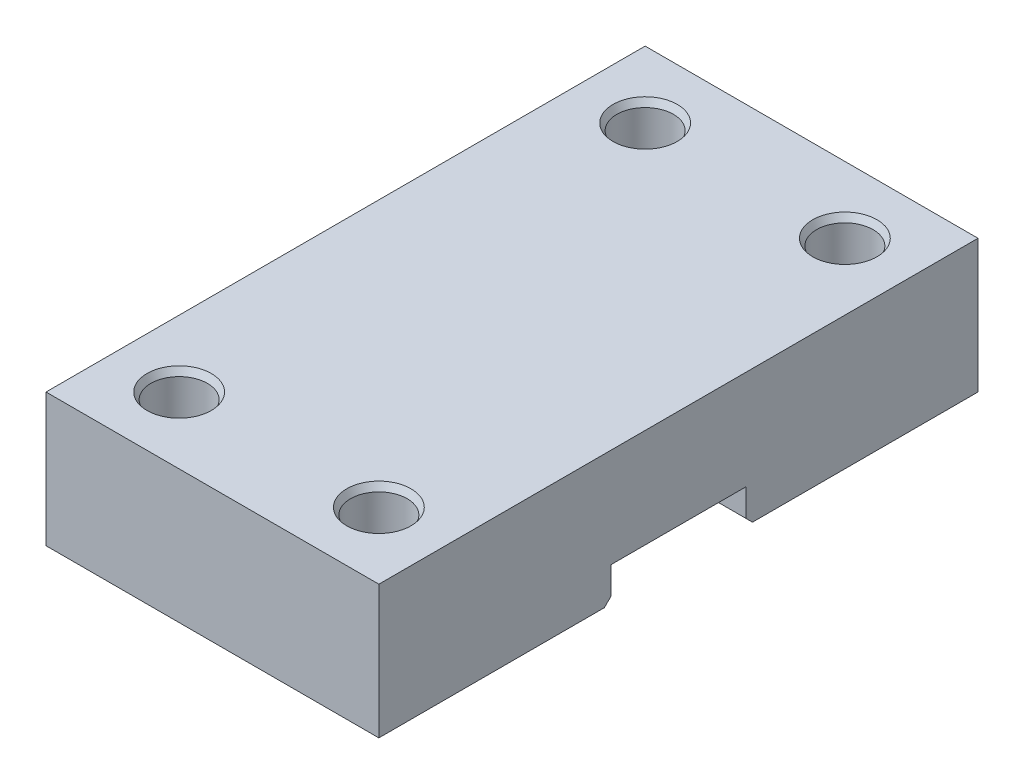
ISO-10303-21;
HEADER;
FILE_DESCRIPTION(('STEP AP214'),'2;1');
FILE_NAME('part.step','',(''),(''),'','','');
FILE_SCHEMA(('AUTOMOTIVE_DESIGN { 1 0 10303 214 1 1 1 1 }'));
ENDSEC;
DATA;
#1=APPLICATION_CONTEXT('core data for automotive mechanical design processes');
#2=APPLICATION_PROTOCOL_DEFINITION('international standard','automotive_design',2000,#1);
#3=PRODUCT_CONTEXT('',#1,'mechanical');
#4=PRODUCT('Part','Part','',(#3));
#5=PRODUCT_RELATED_PRODUCT_CATEGORY('part','',(#4));
#6=PRODUCT_DEFINITION_FORMATION('','',#4);
#7=PRODUCT_DEFINITION_CONTEXT('part definition',#1,'design');
#8=PRODUCT_DEFINITION('design','',#6,#7);
#9=PRODUCT_DEFINITION_SHAPE('','',#8);
#10=(LENGTH_UNIT() NAMED_UNIT(*) SI_UNIT(.MILLI.,.METRE.));
#11=(NAMED_UNIT(*) PLANE_ANGLE_UNIT() SI_UNIT($,.RADIAN.));
#12=(NAMED_UNIT(*) SI_UNIT($,.STERADIAN.) SOLID_ANGLE_UNIT());
#13=UNCERTAINTY_MEASURE_WITH_UNIT(LENGTH_MEASURE(1.E-05),#10,'distance_accuracy_value','');
#14=(GEOMETRIC_REPRESENTATION_CONTEXT(3) GLOBAL_UNCERTAINTY_ASSIGNED_CONTEXT((#13)) GLOBAL_UNIT_ASSIGNED_CONTEXT((#10,
#11,#12)) REPRESENTATION_CONTEXT('',''));
#15=CARTESIAN_POINT('',(0.,0.,0.));
#16=DIRECTION('',(0.,0.,1.));
#17=DIRECTION('',(1.,0.,0.));
#18=AXIS2_PLACEMENT_3D('',#15,#16,#17);
#19=CARTESIAN_POINT('',(0.,0.,0.));
#20=DIRECTION('',(0.,1.,0.));
#21=DIRECTION('',(0.,0.,1.));
#22=AXIS2_PLACEMENT_3D('',#19,#20,#21);
#23=PLANE('',#22);
#24=CARTESIAN_POINT('',(15.,0.,35.));
#25=DIRECTION('',(0.,-1.,0.));
#26=DIRECTION('',(0.,0.,-1.));
#27=AXIS2_PLACEMENT_3D('',#24,#25,#26);
#28=CIRCLE('',#27,4.25);
#29=CARTESIAN_POINT('',(15.,0.,30.75));
#30=VERTEX_POINT('',#29);
#31=EDGE_CURVE('E241',#30,#30,#28,.T.);
#32=ORIENTED_EDGE('',*,*,#31,.F.);
#33=EDGE_LOOP('',(#32));
#34=FACE_BOUND('',#33,.T.);
#35=CARTESIAN_POINT('',(-15.,0.,35.));
#36=DIRECTION('',(0.,-1.,0.));
#37=DIRECTION('',(0.,0.,-1.));
#38=AXIS2_PLACEMENT_3D('',#35,#36,#37);
#39=CIRCLE('',#38,4.25);
#40=CARTESIAN_POINT('',(-15.,0.,30.75));
#41=VERTEX_POINT('',#40);
#42=EDGE_CURVE('E239',#41,#41,#39,.T.);
#43=ORIENTED_EDGE('',*,*,#42,.F.);
#44=EDGE_LOOP('',(#43));
#45=FACE_BOUND('',#44,.T.);
#46=DIRECTION('',(0.,0.,1.));
#47=VECTOR('',#46,1.);
#48=CARTESIAN_POINT('',(-25.,0.,45.));
#49=LINE('',#48,#47);
#50=CARTESIAN_POINT('',(-25.,0.,11.125));
#51=VERTEX_POINT('',#50);
#52=CARTESIAN_POINT('',(-25.,0.,45.));
#53=VERTEX_POINT('',#52);
#54=EDGE_CURVE('E142',#51,#53,#49,.T.);
#55=ORIENTED_EDGE('',*,*,#54,.F.);
#56=DIRECTION('',(1.,0.,0.));
#57=VECTOR('',#56,1.);
#58=CARTESIAN_POINT('',(0.,0.,11.125));
#59=LINE('',#58,#57);
#60=CARTESIAN_POINT('',(25.,0.,11.125));
#61=VERTEX_POINT('',#60);
#62=EDGE_CURVE('E42',#51,#61,#59,.T.);
#63=ORIENTED_EDGE('',*,*,#62,.T.);
#64=DIRECTION('',(0.,0.,-1.));
#65=VECTOR('',#64,1.);
#66=CARTESIAN_POINT('',(25.,0.,45.));
#67=LINE('',#66,#65);
#68=CARTESIAN_POINT('',(25.,0.,45.));
#69=VERTEX_POINT('',#68);
#70=EDGE_CURVE('E159',#69,#61,#67,.T.);
#71=ORIENTED_EDGE('',*,*,#70,.F.);
#72=DIRECTION('',(1.,0.,0.));
#73=VECTOR('',#72,1.);
#74=CARTESIAN_POINT('',(25.,0.,45.));
#75=LINE('',#74,#73);
#76=EDGE_CURVE('E156',#53,#69,#75,.T.);
#77=ORIENTED_EDGE('',*,*,#76,.F.);
#78=EDGE_LOOP('',(#55,#63,#71,#77));
#79=FACE_BOUND('',#78,.T.);
#80=ADVANCED_FACE('F34',(#34,#45,#79),#23,.F.);
#81=CARTESIAN_POINT('',(-25.,20.,45.));
#82=DIRECTION('',(1.,0.,0.));
#83=DIRECTION('',(0.,0.,-1.));
#84=AXIS2_PLACEMENT_3D('',#81,#82,#83);
#85=PLANE('',#84);
#86=CARTESIAN_POINT('',(-25.,0.,-45.));
#87=VERTEX_POINT('',#86);
#88=CARTESIAN_POINT('',(-25.,0.,-11.125));
#89=VERTEX_POINT('',#88);
#90=EDGE_CURVE('E154',#87,#89,#49,.T.);
#91=ORIENTED_EDGE('',*,*,#90,.T.);
#92=DIRECTION('',(0.,-0.707106781186552,-0.707106781186543));
#93=VECTOR('',#92,1.);
#94=CARTESIAN_POINT('',(-25.,1.00000000000003,-10.125));
#95=LINE('',#94,#93);
#96=CARTESIAN_POINT('',(-25.,1.00000000000003,-10.125));
#97=VERTEX_POINT('',#96);
#98=EDGE_CURVE('E117',#89,#97,#95,.F.);
#99=ORIENTED_EDGE('',*,*,#98,.T.);
#100=DIRECTION('',(0.,1.,0.));
#101=VECTOR('',#100,1.);
#102=CARTESIAN_POINT('',(-25.,5.10000000000001,-10.125));
#103=LINE('',#102,#101);
#104=CARTESIAN_POINT('',(-25.,5.10000000000001,-10.125));
#105=VERTEX_POINT('',#104);
#106=EDGE_CURVE('E110',#97,#105,#103,.T.);
#107=ORIENTED_EDGE('',*,*,#106,.T.);
#108=DIRECTION('',(0.,0.,1.));
#109=VECTOR('',#108,1.);
#110=CARTESIAN_POINT('',(-25.,5.10000000000001,-10.125));
#111=LINE('',#110,#109);
#112=CARTESIAN_POINT('',(-25.,5.1,10.125));
#113=VERTEX_POINT('',#112);
#114=EDGE_CURVE('E115',#105,#113,#111,.T.);
#115=ORIENTED_EDGE('',*,*,#114,.T.);
#116=DIRECTION('',(0.,-1.,0.));
#117=VECTOR('',#116,1.);
#118=CARTESIAN_POINT('',(-25.,5.1,10.125));
#119=LINE('',#118,#117);
#120=CARTESIAN_POINT('',(-25.,1.00000000000001,10.125));
#121=VERTEX_POINT('',#120);
#122=EDGE_CURVE('E121',#113,#121,#119,.T.);
#123=ORIENTED_EDGE('',*,*,#122,.T.);
#124=DIRECTION('',(0.,0.707106781186548,-0.707106781186548));
#125=VECTOR('',#124,1.);
#126=CARTESIAN_POINT('',(-25.,0.,11.125));
#127=LINE('',#126,#125);
#128=EDGE_CURVE('E49',#121,#51,#127,.F.);
#129=ORIENTED_EDGE('',*,*,#128,.T.);
#130=ORIENTED_EDGE('',*,*,#54,.T.);
#131=DIRECTION('',(0.,-1.,0.));
#132=VECTOR('',#131,1.);
#133=CARTESIAN_POINT('',(-25.,20.,45.));
#134=LINE('',#133,#132);
#135=CARTESIAN_POINT('',(-25.,20.,45.));
#136=VERTEX_POINT('',#135);
#137=EDGE_CURVE('E171',#136,#53,#134,.T.);
#138=ORIENTED_EDGE('',*,*,#137,.F.);
#139=DIRECTION('',(0.,0.,1.));
#140=VECTOR('',#139,1.);
#141=CARTESIAN_POINT('',(-25.,20.,45.));
#142=LINE('',#141,#140);
#143=CARTESIAN_POINT('',(-25.,20.,-45.));
#144=VERTEX_POINT('',#143);
#145=EDGE_CURVE('E143',#144,#136,#142,.T.);
#146=ORIENTED_EDGE('',*,*,#145,.F.);
#147=DIRECTION('',(0.,-1.,0.));
#148=VECTOR('',#147,1.);
#149=CARTESIAN_POINT('',(-25.,20.,-45.));
#150=LINE('',#149,#148);
#151=EDGE_CURVE('E153',#144,#87,#150,.T.);
#152=ORIENTED_EDGE('',*,*,#151,.T.);
#153=EDGE_LOOP('',(#91,#99,#107,#115,#123,#129,#130,#138,#146,#152));
#154=FACE_BOUND('',#153,.T.);
#155=ADVANCED_FACE('F113',(#154),#85,.F.);
#156=CARTESIAN_POINT('',(25.,20.,45.));
#157=DIRECTION('',(0.,0.,-1.));
#158=DIRECTION('',(-1.,0.,0.));
#159=AXIS2_PLACEMENT_3D('',#156,#157,#158);
#160=PLANE('',#159);
#161=ORIENTED_EDGE('',*,*,#76,.T.);
#162=DIRECTION('',(0.,-1.,0.));
#163=VECTOR('',#162,1.);
#164=CARTESIAN_POINT('',(25.,20.,45.));
#165=LINE('',#164,#163);
#166=CARTESIAN_POINT('',(25.,20.,45.));
#167=VERTEX_POINT('',#166);
#168=EDGE_CURVE('E168',#167,#69,#165,.T.);
#169=ORIENTED_EDGE('',*,*,#168,.F.);
#170=DIRECTION('',(1.,0.,0.));
#171=VECTOR('',#170,1.);
#172=CARTESIAN_POINT('',(25.,20.,45.));
#173=LINE('',#172,#171);
#174=EDGE_CURVE('E146',#136,#167,#173,.T.);
#175=ORIENTED_EDGE('',*,*,#174,.F.);
#176=ORIENTED_EDGE('',*,*,#137,.T.);
#177=EDGE_LOOP('',(#161,#169,#175,#176));
#178=FACE_BOUND('',#177,.T.);
#179=ADVANCED_FACE('F221',(#178),#160,.F.);
#180=CARTESIAN_POINT('',(25.,20.,45.));
#181=DIRECTION('',(-1.,0.,0.));
#182=DIRECTION('',(0.,0.,1.));
#183=AXIS2_PLACEMENT_3D('',#180,#181,#182);
#184=PLANE('',#183);
#185=DIRECTION('',(0.,-1.,0.));
#186=VECTOR('',#185,1.);
#187=CARTESIAN_POINT('',(25.,20.,-10.125));
#188=LINE('',#187,#186);
#189=CARTESIAN_POINT('',(25.,5.10000000000001,-10.125));
#190=VERTEX_POINT('',#189);
#191=CARTESIAN_POINT('',(25.,1.00000000000003,-10.125));
#192=VERTEX_POINT('',#191);
#193=EDGE_CURVE('E127',#190,#192,#188,.T.);
#194=ORIENTED_EDGE('',*,*,#193,.T.);
#195=DIRECTION('',(0.,0.707106781186552,0.707106781186543));
#196=VECTOR('',#195,1.);
#197=CARTESIAN_POINT('',(25.,1.00000000000003,-10.125));
#198=LINE('',#197,#196);
#199=CARTESIAN_POINT('',(25.,0.,-11.125));
#200=VERTEX_POINT('',#199);
#201=EDGE_CURVE('E204',#192,#200,#198,.F.);
#202=ORIENTED_EDGE('',*,*,#201,.T.);
#203=CARTESIAN_POINT('',(25.,0.,-45.));
#204=VERTEX_POINT('',#203);
#205=EDGE_CURVE('E158',#200,#204,#67,.T.);
#206=ORIENTED_EDGE('',*,*,#205,.T.);
#207=DIRECTION('',(0.,-1.,0.));
#208=VECTOR('',#207,1.);
#209=CARTESIAN_POINT('',(25.,20.,-45.));
#210=LINE('',#209,#208);
#211=CARTESIAN_POINT('',(25.,20.,-45.));
#212=VERTEX_POINT('',#211);
#213=EDGE_CURVE('E165',#212,#204,#210,.T.);
#214=ORIENTED_EDGE('',*,*,#213,.F.);
#215=DIRECTION('',(0.,0.,-1.));
#216=VECTOR('',#215,1.);
#217=CARTESIAN_POINT('',(25.,20.,45.));
#218=LINE('',#217,#216);
#219=EDGE_CURVE('E149',#167,#212,#218,.T.);
#220=ORIENTED_EDGE('',*,*,#219,.F.);
#221=ORIENTED_EDGE('',*,*,#168,.T.);
#222=ORIENTED_EDGE('',*,*,#70,.T.);
#223=DIRECTION('',(0.,-0.707106781186548,0.707106781186548));
#224=VECTOR('',#223,1.);
#225=CARTESIAN_POINT('',(25.,0.,11.125));
#226=LINE('',#225,#224);
#227=CARTESIAN_POINT('',(25.,1.00000000000001,10.125));
#228=VERTEX_POINT('',#227);
#229=EDGE_CURVE('E202',#61,#228,#226,.F.);
#230=ORIENTED_EDGE('',*,*,#229,.T.);
#231=DIRECTION('',(0.,1.,0.));
#232=VECTOR('',#231,1.);
#233=CARTESIAN_POINT('',(25.,20.,10.125));
#234=LINE('',#233,#232);
#235=CARTESIAN_POINT('',(25.,5.1,10.125));
#236=VERTEX_POINT('',#235);
#237=EDGE_CURVE('E140',#228,#236,#234,.T.);
#238=ORIENTED_EDGE('',*,*,#237,.T.);
#239=DIRECTION('',(0.,0.,-1.));
#240=VECTOR('',#239,1.);
#241=CARTESIAN_POINT('',(25.,5.1,45.));
#242=LINE('',#241,#240);
#243=EDGE_CURVE('E174',#236,#190,#242,.T.);
#244=ORIENTED_EDGE('',*,*,#243,.T.);
#245=EDGE_LOOP('',(#194,#202,#206,#214,#220,#221,#222,#230,#238,#244));
#246=FACE_BOUND('',#245,.T.);
#247=ADVANCED_FACE('F216',(#246),#184,.F.);
#248=CARTESIAN_POINT('',(25.,20.,-45.));
#249=DIRECTION('',(0.,0.,1.));
#250=DIRECTION('',(1.,0.,0.));
#251=AXIS2_PLACEMENT_3D('',#248,#249,#250);
#252=PLANE('',#251);
#253=DIRECTION('',(-1.,0.,0.));
#254=VECTOR('',#253,1.);
#255=CARTESIAN_POINT('',(25.,0.,-45.));
#256=LINE('',#255,#254);
#257=EDGE_CURVE('E147',#204,#87,#256,.T.);
#258=ORIENTED_EDGE('',*,*,#257,.T.);
#259=ORIENTED_EDGE('',*,*,#151,.F.);
#260=DIRECTION('',(-1.,0.,0.));
#261=VECTOR('',#260,1.);
#262=CARTESIAN_POINT('',(25.,20.,-45.));
#263=LINE('',#262,#261);
#264=EDGE_CURVE('E151',#212,#144,#263,.T.);
#265=ORIENTED_EDGE('',*,*,#264,.F.);
#266=ORIENTED_EDGE('',*,*,#213,.T.);
#267=EDGE_LOOP('',(#258,#259,#265,#266));
#268=FACE_BOUND('',#267,.T.);
#269=ADVANCED_FACE('F230',(#268),#252,.F.);
#270=CARTESIAN_POINT('',(0.,20.,0.));
#271=DIRECTION('',(0.,1.,0.));
#272=DIRECTION('',(0.,0.,1.));
#273=AXIS2_PLACEMENT_3D('',#270,#271,#272);
#274=PLANE('',#273);
#275=CARTESIAN_POINT('',(15.,20.,-35.));
#276=DIRECTION('',(0.,1.,0.));
#277=DIRECTION('',(0.,0.,1.));
#278=AXIS2_PLACEMENT_3D('',#275,#276,#277);
#279=CIRCLE('',#278,4.82735026918962);
#280=CARTESIAN_POINT('',(15.,20.,-30.1726497308104));
#281=VERTEX_POINT('',#280);
#282=EDGE_CURVE('E185',#281,#281,#279,.F.);
#283=ORIENTED_EDGE('',*,*,#282,.T.);
#284=EDGE_LOOP('',(#283));
#285=FACE_BOUND('',#284,.T.);
#286=CARTESIAN_POINT('',(15.,20.,35.));
#287=DIRECTION('',(0.,1.,0.));
#288=DIRECTION('',(0.,0.,1.));
#289=AXIS2_PLACEMENT_3D('',#286,#287,#288);
#290=CIRCLE('',#289,4.82735026918962);
#291=CARTESIAN_POINT('',(15.,20.,39.8273502691896));
#292=VERTEX_POINT('',#291);
#293=EDGE_CURVE('E182',#292,#292,#290,.F.);
#294=ORIENTED_EDGE('',*,*,#293,.T.);
#295=EDGE_LOOP('',(#294));
#296=FACE_BOUND('',#295,.T.);
#297=CARTESIAN_POINT('',(-15.,20.,35.));
#298=DIRECTION('',(0.,1.,0.));
#299=DIRECTION('',(0.,0.,1.));
#300=AXIS2_PLACEMENT_3D('',#297,#298,#299);
#301=CIRCLE('',#300,4.82735026918962);
#302=CARTESIAN_POINT('',(-15.,20.,39.8273502691896));
#303=VERTEX_POINT('',#302);
#304=EDGE_CURVE('E179',#303,#303,#301,.F.);
#305=ORIENTED_EDGE('',*,*,#304,.T.);
#306=EDGE_LOOP('',(#305));
#307=FACE_BOUND('',#306,.T.);
#308=CARTESIAN_POINT('',(-15.,20.,-35.));
#309=DIRECTION('',(0.,1.,0.));
#310=DIRECTION('',(0.,0.,1.));
#311=AXIS2_PLACEMENT_3D('',#308,#309,#310);
#312=CIRCLE('',#311,4.82735026918962);
#313=CARTESIAN_POINT('',(-15.,20.,-30.1726497308104));
#314=VERTEX_POINT('',#313);
#315=EDGE_CURVE('E176',#314,#314,#312,.F.);
#316=ORIENTED_EDGE('',*,*,#315,.T.);
#317=EDGE_LOOP('',(#316));
#318=FACE_BOUND('',#317,.T.);
#319=ORIENTED_EDGE('',*,*,#145,.T.);
#320=ORIENTED_EDGE('',*,*,#174,.T.);
#321=ORIENTED_EDGE('',*,*,#219,.T.);
#322=ORIENTED_EDGE('',*,*,#264,.T.);
#323=EDGE_LOOP('',(#319,#320,#321,#322));
#324=FACE_BOUND('',#323,.T.);
#325=ADVANCED_FACE('F227',(#285,#296,#307,#318,#324),#274,.T.);
#326=CARTESIAN_POINT('',(15.,0.,-35.));
#327=DIRECTION('',(0.,-1.,0.));
#328=DIRECTION('',(0.,0.,-1.));
#329=AXIS2_PLACEMENT_3D('',#326,#327,#328);
#330=CIRCLE('',#329,4.25);
#331=CARTESIAN_POINT('',(15.,0.,-39.25));
#332=VERTEX_POINT('',#331);
#333=EDGE_CURVE('E247',#332,#332,#330,.T.);
#334=ORIENTED_EDGE('',*,*,#333,.F.);
#335=EDGE_LOOP('',(#334));
#336=FACE_BOUND('',#335,.T.);
#337=CARTESIAN_POINT('',(-15.,0.,-35.));
#338=DIRECTION('',(0.,-1.,0.));
#339=DIRECTION('',(0.,0.,-1.));
#340=AXIS2_PLACEMENT_3D('',#337,#338,#339);
#341=CIRCLE('',#340,4.25);
#342=CARTESIAN_POINT('',(-15.,0.,-39.25));
#343=VERTEX_POINT('',#342);
#344=EDGE_CURVE('E244',#343,#343,#341,.T.);
#345=ORIENTED_EDGE('',*,*,#344,.F.);
#346=EDGE_LOOP('',(#345));
#347=FACE_BOUND('',#346,.T.);
#348=ORIENTED_EDGE('',*,*,#205,.F.);
#349=DIRECTION('',(-1.,0.,0.));
#350=VECTOR('',#349,1.);
#351=CARTESIAN_POINT('',(0.,0.,-11.125));
#352=LINE('',#351,#350);
#353=EDGE_CURVE('E206',#200,#89,#352,.T.);
#354=ORIENTED_EDGE('',*,*,#353,.T.);
#355=ORIENTED_EDGE('',*,*,#90,.F.);
#356=ORIENTED_EDGE('',*,*,#257,.F.);
#357=EDGE_LOOP('',(#348,#354,#355,#356));
#358=FACE_BOUND('',#357,.T.);
#359=ADVANCED_FACE('F234',(#336,#347,#358),#23,.F.);
#360=CARTESIAN_POINT('',(-25.,5.10000000000001,-10.125));
#361=DIRECTION('',(0.,1.,0.));
#362=DIRECTION('',(0.,0.,1.));
#363=AXIS2_PLACEMENT_3D('',#360,#361,#362);
#364=PLANE('',#363);
#365=DIRECTION('',(1.,0.,0.));
#366=VECTOR('',#365,1.);
#367=CARTESIAN_POINT('',(-25.,5.1,10.125));
#368=LINE('',#367,#366);
#369=EDGE_CURVE('E131',#113,#236,#368,.T.);
#370=ORIENTED_EDGE('',*,*,#369,.F.);
#371=ORIENTED_EDGE('',*,*,#114,.F.);
#372=DIRECTION('',(1.,0.,0.));
#373=VECTOR('',#372,1.);
#374=CARTESIAN_POINT('',(-25.,5.10000000000001,-10.125));
#375=LINE('',#374,#373);
#376=EDGE_CURVE('E124',#105,#190,#375,.T.);
#377=ORIENTED_EDGE('',*,*,#376,.T.);
#378=ORIENTED_EDGE('',*,*,#243,.F.);
#379=EDGE_LOOP('',(#370,#371,#377,#378));
#380=FACE_BOUND('',#379,.T.);
#381=ADVANCED_FACE('F133',(#380),#364,.F.);
#382=CARTESIAN_POINT('',(-25.,5.1,10.125));
#383=DIRECTION('',(0.,0.,1.));
#384=DIRECTION('',(1.,0.,0.));
#385=AXIS2_PLACEMENT_3D('',#382,#383,#384);
#386=PLANE('',#385);
#387=ORIENTED_EDGE('',*,*,#237,.F.);
#388=DIRECTION('',(-1.,0.,0.));
#389=VECTOR('',#388,1.);
#390=CARTESIAN_POINT('',(-25.,1.00000000000001,10.125));
#391=LINE('',#390,#389);
#392=EDGE_CURVE('E11',#228,#121,#391,.T.);
#393=ORIENTED_EDGE('',*,*,#392,.T.);
#394=ORIENTED_EDGE('',*,*,#122,.F.);
#395=ORIENTED_EDGE('',*,*,#369,.T.);
#396=EDGE_LOOP('',(#387,#393,#394,#395));
#397=FACE_BOUND('',#396,.T.);
#398=ADVANCED_FACE('F238',(#397),#386,.F.);
#399=CARTESIAN_POINT('',(-25.,5.10000000000001,-10.125));
#400=DIRECTION('',(0.,0.,-1.));
#401=DIRECTION('',(0.,1.,0.));
#402=AXIS2_PLACEMENT_3D('',#399,#400,#401);
#403=PLANE('',#402);
#404=ORIENTED_EDGE('',*,*,#106,.F.);
#405=DIRECTION('',(1.,0.,0.));
#406=VECTOR('',#405,1.);
#407=CARTESIAN_POINT('',(-25.,1.00000000000003,-10.125));
#408=LINE('',#407,#406);
#409=EDGE_CURVE('E200',#97,#192,#408,.T.);
#410=ORIENTED_EDGE('',*,*,#409,.T.);
#411=ORIENTED_EDGE('',*,*,#193,.F.);
#412=ORIENTED_EDGE('',*,*,#376,.F.);
#413=EDGE_LOOP('',(#404,#410,#411,#412));
#414=FACE_BOUND('',#413,.T.);
#415=ADVANCED_FACE('F125',(#414),#403,.F.);
#416=CARTESIAN_POINT('',(-15.,20.,35.));
#417=DIRECTION('',(0.,-1.,0.));
#418=DIRECTION('',(0.,0.,-1.));
#419=AXIS2_PLACEMENT_3D('',#416,#417,#418);
#420=CYLINDRICAL_SURFACE('',#419,4.25);
#421=CARTESIAN_POINT('',(-15.,19.,35.));
#422=DIRECTION('',(0.,1.,0.));
#423=DIRECTION('',(0.,0.,1.));
#424=AXIS2_PLACEMENT_3D('',#421,#422,#423);
#425=CIRCLE('',#424,4.25);
#426=CARTESIAN_POINT('',(-15.,19.,39.25));
#427=VERTEX_POINT('',#426);
#428=EDGE_CURVE('E194',#427,#427,#425,.T.);
#429=ORIENTED_EDGE('',*,*,#428,.T.);
#430=EDGE_LOOP('',(#429));
#431=FACE_BOUND('',#430,.T.);
#432=ORIENTED_EDGE('',*,*,#42,.T.);
#433=EDGE_LOOP('',(#432));
#434=FACE_BOUND('',#433,.T.);
#435=ADVANCED_FACE('F260',(#431,#434),#420,.F.);
#436=CARTESIAN_POINT('',(-15.,20.,-35.));
#437=DIRECTION('',(0.,-1.,0.));
#438=DIRECTION('',(0.,0.,-1.));
#439=AXIS2_PLACEMENT_3D('',#436,#437,#438);
#440=CYLINDRICAL_SURFACE('',#439,4.25);
#441=CARTESIAN_POINT('',(-15.,19.,-35.));
#442=DIRECTION('',(0.,1.,0.));
#443=DIRECTION('',(0.,0.,1.));
#444=AXIS2_PLACEMENT_3D('',#441,#442,#443);
#445=CIRCLE('',#444,4.25);
#446=CARTESIAN_POINT('',(-15.,19.,-30.75));
#447=VERTEX_POINT('',#446);
#448=EDGE_CURVE('E197',#447,#447,#445,.T.);
#449=ORIENTED_EDGE('',*,*,#448,.T.);
#450=EDGE_LOOP('',(#449));
#451=FACE_BOUND('',#450,.T.);
#452=ORIENTED_EDGE('',*,*,#344,.T.);
#453=EDGE_LOOP('',(#452));
#454=FACE_BOUND('',#453,.T.);
#455=ADVANCED_FACE('F262',(#451,#454),#440,.F.);
#456=CARTESIAN_POINT('',(15.,20.,-35.));
#457=DIRECTION('',(0.,-1.,0.));
#458=DIRECTION('',(0.,0.,-1.));
#459=AXIS2_PLACEMENT_3D('',#456,#457,#458);
#460=CYLINDRICAL_SURFACE('',#459,4.25);
#461=CARTESIAN_POINT('',(15.,19.,-35.));
#462=DIRECTION('',(0.,1.,0.));
#463=DIRECTION('',(0.,0.,1.));
#464=AXIS2_PLACEMENT_3D('',#461,#462,#463);
#465=CIRCLE('',#464,4.25);
#466=CARTESIAN_POINT('',(15.,19.,-30.75));
#467=VERTEX_POINT('',#466);
#468=EDGE_CURVE('E188',#467,#467,#465,.T.);
#469=ORIENTED_EDGE('',*,*,#468,.T.);
#470=EDGE_LOOP('',(#469));
#471=FACE_BOUND('',#470,.T.);
#472=ORIENTED_EDGE('',*,*,#333,.T.);
#473=EDGE_LOOP('',(#472));
#474=FACE_BOUND('',#473,.T.);
#475=ADVANCED_FACE('F269',(#471,#474),#460,.F.);
#476=CARTESIAN_POINT('',(15.,20.,35.));
#477=DIRECTION('',(0.,-1.,0.));
#478=DIRECTION('',(0.,0.,-1.));
#479=AXIS2_PLACEMENT_3D('',#476,#477,#478);
#480=CYLINDRICAL_SURFACE('',#479,4.25);
#481=CARTESIAN_POINT('',(15.,19.,35.));
#482=DIRECTION('',(0.,1.,0.));
#483=DIRECTION('',(0.,0.,1.));
#484=AXIS2_PLACEMENT_3D('',#481,#482,#483);
#485=CIRCLE('',#484,4.25);
#486=CARTESIAN_POINT('',(15.,19.,39.25));
#487=VERTEX_POINT('',#486);
#488=EDGE_CURVE('E191',#487,#487,#485,.T.);
#489=ORIENTED_EDGE('',*,*,#488,.T.);
#490=EDGE_LOOP('',(#489));
#491=FACE_BOUND('',#490,.T.);
#492=ORIENTED_EDGE('',*,*,#31,.T.);
#493=EDGE_LOOP('',(#492));
#494=FACE_BOUND('',#493,.T.);
#495=ADVANCED_FACE('F253',(#491,#494),#480,.F.);
#496=CARTESIAN_POINT('',(15.,20.,-35.));
#497=DIRECTION('',(0.,1.,0.));
#498=DIRECTION('',(0.,0.,1.));
#499=AXIS2_PLACEMENT_3D('',#496,#497,#498);
#500=CONICAL_SURFACE('',#499,4.82735026918962,0.523598775598292);
#501=ORIENTED_EDGE('',*,*,#468,.F.);
#502=EDGE_LOOP('',(#501));
#503=FACE_BOUND('',#502,.T.);
#504=ORIENTED_EDGE('',*,*,#282,.F.);
#505=EDGE_LOOP('',(#504));
#506=FACE_BOUND('',#505,.T.);
#507=ADVANCED_FACE('F292',(#503,#506),#500,.F.);
#508=CARTESIAN_POINT('',(15.,20.,35.));
#509=DIRECTION('',(0.,1.,0.));
#510=DIRECTION('',(0.,0.,1.));
#511=AXIS2_PLACEMENT_3D('',#508,#509,#510);
#512=CONICAL_SURFACE('',#511,4.82735026918962,0.523598775598294);
#513=ORIENTED_EDGE('',*,*,#488,.F.);
#514=EDGE_LOOP('',(#513));
#515=FACE_BOUND('',#514,.T.);
#516=ORIENTED_EDGE('',*,*,#293,.F.);
#517=EDGE_LOOP('',(#516));
#518=FACE_BOUND('',#517,.T.);
#519=ADVANCED_FACE('F295',(#515,#518),#512,.F.);
#520=CARTESIAN_POINT('',(-15.,20.,35.));
#521=DIRECTION('',(0.,1.,0.));
#522=DIRECTION('',(0.,0.,1.));
#523=AXIS2_PLACEMENT_3D('',#520,#521,#522);
#524=CONICAL_SURFACE('',#523,4.82735026918962,0.523598775598294);
#525=ORIENTED_EDGE('',*,*,#428,.F.);
#526=EDGE_LOOP('',(#525));
#527=FACE_BOUND('',#526,.T.);
#528=ORIENTED_EDGE('',*,*,#304,.F.);
#529=EDGE_LOOP('',(#528));
#530=FACE_BOUND('',#529,.T.);
#531=ADVANCED_FACE('F299',(#527,#530),#524,.F.);
#532=CARTESIAN_POINT('',(-15.,20.,-35.));
#533=DIRECTION('',(0.,1.,0.));
#534=DIRECTION('',(0.,0.,1.));
#535=AXIS2_PLACEMENT_3D('',#532,#533,#534);
#536=CONICAL_SURFACE('',#535,4.82735026918962,0.523598775598293);
#537=ORIENTED_EDGE('',*,*,#448,.F.);
#538=EDGE_LOOP('',(#537));
#539=FACE_BOUND('',#538,.T.);
#540=ORIENTED_EDGE('',*,*,#315,.F.);
#541=EDGE_LOOP('',(#540));
#542=FACE_BOUND('',#541,.T.);
#543=ADVANCED_FACE('F303',(#539,#542),#536,.F.);
#544=CARTESIAN_POINT('',(-25.,1.00000000000003,-10.125));
#545=DIRECTION('',(0.,0.707106781186543,-0.707106781186552));
#546=DIRECTION('',(1.,0.,0.));
#547=AXIS2_PLACEMENT_3D('',#544,#545,#546);
#548=PLANE('',#547);
#549=ORIENTED_EDGE('',*,*,#98,.F.);
#550=ORIENTED_EDGE('',*,*,#353,.F.);
#551=ORIENTED_EDGE('',*,*,#201,.F.);
#552=ORIENTED_EDGE('',*,*,#409,.F.);
#553=EDGE_LOOP('',(#549,#550,#551,#552));
#554=FACE_BOUND('',#553,.T.);
#555=ADVANCED_FACE('F237',(#554),#548,.F.);
#556=CARTESIAN_POINT('',(0.,0.,11.125));
#557=DIRECTION('',(0.,0.707106781186547,0.707106781186547));
#558=DIRECTION('',(1.,0.,0.));
#559=AXIS2_PLACEMENT_3D('',#556,#557,#558);
#560=PLANE('',#559);
#561=ORIENTED_EDGE('',*,*,#128,.F.);
#562=ORIENTED_EDGE('',*,*,#392,.F.);
#563=ORIENTED_EDGE('',*,*,#229,.F.);
#564=ORIENTED_EDGE('',*,*,#62,.F.);
#565=EDGE_LOOP('',(#561,#562,#563,#564));
#566=FACE_BOUND('',#565,.T.);
#567=ADVANCED_FACE('F36',(#566),#560,.F.);
#568=CLOSED_SHELL('',(#80,#155,#179,#247,#269,#325,#359,#381,#398,#415,#435,#455,#475,#495,#507,
#519,#531,#543,#555,#567));
#569=MANIFOLD_SOLID_BREP('B2',#568);
#570=ADVANCED_BREP_SHAPE_REPRESENTATION('',(#18,#569),#14);
#571=SHAPE_DEFINITION_REPRESENTATION(#9,#570);
ENDSEC;
END-ISO-10303-21;
